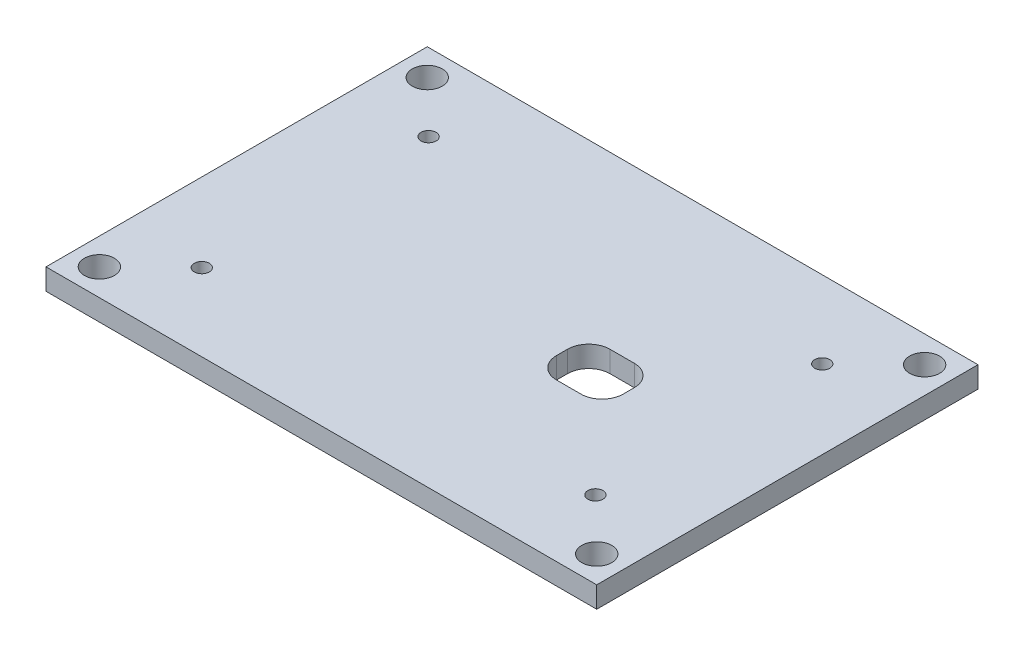
ISO-10303-21;
HEADER;
FILE_DESCRIPTION(('STEP AP214'),'2;1');
FILE_NAME('part.step','',(''),(''),'','','');
FILE_SCHEMA(('AUTOMOTIVE_DESIGN { 1 0 10303 214 1 1 1 1 }'));
ENDSEC;
DATA;
#1=APPLICATION_CONTEXT('core data for automotive mechanical design processes');
#2=APPLICATION_PROTOCOL_DEFINITION('international standard','automotive_design',2000,#1);
#3=PRODUCT_CONTEXT('',#1,'mechanical');
#4=PRODUCT('Part','Part','',(#3));
#5=PRODUCT_RELATED_PRODUCT_CATEGORY('part','',(#4));
#6=PRODUCT_DEFINITION_FORMATION('','',#4);
#7=PRODUCT_DEFINITION_CONTEXT('part definition',#1,'design');
#8=PRODUCT_DEFINITION('design','',#6,#7);
#9=PRODUCT_DEFINITION_SHAPE('','',#8);
#10=(LENGTH_UNIT() NAMED_UNIT(*) SI_UNIT(.MILLI.,.METRE.));
#11=(NAMED_UNIT(*) PLANE_ANGLE_UNIT() SI_UNIT($,.RADIAN.));
#12=(NAMED_UNIT(*) SI_UNIT($,.STERADIAN.) SOLID_ANGLE_UNIT());
#13=UNCERTAINTY_MEASURE_WITH_UNIT(LENGTH_MEASURE(1.E-05),#10,'distance_accuracy_value','');
#14=(GEOMETRIC_REPRESENTATION_CONTEXT(3) GLOBAL_UNCERTAINTY_ASSIGNED_CONTEXT((#13)) GLOBAL_UNIT_ASSIGNED_CONTEXT((#10,
#11,#12)) REPRESENTATION_CONTEXT('',''));
#15=CARTESIAN_POINT('',(0.,0.,0.));
#16=DIRECTION('',(0.,0.,1.));
#17=DIRECTION('',(1.,0.,0.));
#18=AXIS2_PLACEMENT_3D('',#15,#16,#17);
#19=CARTESIAN_POINT('',(-41.275,3.175,28.575));
#20=DIRECTION('',(1.,0.,0.));
#21=DIRECTION('',(0.,0.,-1.));
#22=AXIS2_PLACEMENT_3D('',#19,#20,#21);
#23=PLANE('',#22);
#24=DIRECTION('',(0.,0.,1.));
#25=VECTOR('',#24,1.);
#26=CARTESIAN_POINT('',(-41.275,0.,28.575));
#27=LINE('',#26,#25);
#28=CARTESIAN_POINT('',(-41.275,0.,-28.575));
#29=VERTEX_POINT('',#28);
#30=CARTESIAN_POINT('',(-41.275,0.,28.575));
#31=VERTEX_POINT('',#30);
#32=EDGE_CURVE('E190',#29,#31,#27,.T.);
#33=ORIENTED_EDGE('',*,*,#32,.T.);
#34=DIRECTION('',(0.,-1.,0.));
#35=VECTOR('',#34,1.);
#36=CARTESIAN_POINT('',(-41.275,3.175,28.575));
#37=LINE('',#36,#35);
#38=CARTESIAN_POINT('',(-41.275,3.175,28.575));
#39=VERTEX_POINT('',#38);
#40=EDGE_CURVE('E11',#39,#31,#37,.T.);
#41=ORIENTED_EDGE('',*,*,#40,.F.);
#42=DIRECTION('',(0.,0.,1.));
#43=VECTOR('',#42,1.);
#44=CARTESIAN_POINT('',(-41.275,3.175,28.575));
#45=LINE('',#44,#43);
#46=CARTESIAN_POINT('',(-41.275,3.175,-28.575));
#47=VERTEX_POINT('',#46);
#48=EDGE_CURVE('E191',#47,#39,#45,.T.);
#49=ORIENTED_EDGE('',*,*,#48,.F.);
#50=DIRECTION('',(0.,-1.,0.));
#51=VECTOR('',#50,1.);
#52=CARTESIAN_POINT('',(-41.275,3.175,-28.575));
#53=LINE('',#52,#51);
#54=EDGE_CURVE('E201',#47,#29,#53,.T.);
#55=ORIENTED_EDGE('',*,*,#54,.T.);
#56=EDGE_LOOP('',(#33,#41,#49,#55));
#57=FACE_BOUND('',#56,.T.);
#58=ADVANCED_FACE('F38',(#57),#23,.F.);
#59=CARTESIAN_POINT('',(41.275,3.175,28.575));
#60=DIRECTION('',(0.,0.,-1.));
#61=DIRECTION('',(-1.,0.,0.));
#62=AXIS2_PLACEMENT_3D('',#59,#60,#61);
#63=PLANE('',#62);
#64=DIRECTION('',(1.,0.,0.));
#65=VECTOR('',#64,1.);
#66=CARTESIAN_POINT('',(41.275,0.,28.575));
#67=LINE('',#66,#65);
#68=CARTESIAN_POINT('',(41.275,0.,28.575));
#69=VERTEX_POINT('',#68);
#70=EDGE_CURVE('E204',#31,#69,#67,.T.);
#71=ORIENTED_EDGE('',*,*,#70,.T.);
#72=DIRECTION('',(0.,-1.,0.));
#73=VECTOR('',#72,1.);
#74=CARTESIAN_POINT('',(41.275,3.175,28.575));
#75=LINE('',#74,#73);
#76=CARTESIAN_POINT('',(41.275,3.175,28.575));
#77=VERTEX_POINT('',#76);
#78=EDGE_CURVE('E45',#77,#69,#75,.T.);
#79=ORIENTED_EDGE('',*,*,#78,.F.);
#80=DIRECTION('',(1.,0.,0.));
#81=VECTOR('',#80,1.);
#82=CARTESIAN_POINT('',(41.275,3.175,28.575));
#83=LINE('',#82,#81);
#84=EDGE_CURVE('E194',#39,#77,#83,.T.);
#85=ORIENTED_EDGE('',*,*,#84,.F.);
#86=ORIENTED_EDGE('',*,*,#40,.T.);
#87=EDGE_LOOP('',(#71,#79,#85,#86));
#88=FACE_BOUND('',#87,.T.);
#89=ADVANCED_FACE('F232',(#88),#63,.F.);
#90=CARTESIAN_POINT('',(41.275,3.175,28.575));
#91=DIRECTION('',(-1.,0.,0.));
#92=DIRECTION('',(0.,0.,1.));
#93=AXIS2_PLACEMENT_3D('',#90,#91,#92);
#94=PLANE('',#93);
#95=DIRECTION('',(0.,0.,-1.));
#96=VECTOR('',#95,1.);
#97=CARTESIAN_POINT('',(41.275,0.,28.575));
#98=LINE('',#97,#96);
#99=CARTESIAN_POINT('',(41.275,0.,-28.575));
#100=VERTEX_POINT('',#99);
#101=EDGE_CURVE('E206',#69,#100,#98,.T.);
#102=ORIENTED_EDGE('',*,*,#101,.T.);
#103=DIRECTION('',(0.,-1.,0.));
#104=VECTOR('',#103,1.);
#105=CARTESIAN_POINT('',(41.275,3.175,-28.575));
#106=LINE('',#105,#104);
#107=CARTESIAN_POINT('',(41.275,3.175,-28.575));
#108=VERTEX_POINT('',#107);
#109=EDGE_CURVE('E211',#108,#100,#106,.T.);
#110=ORIENTED_EDGE('',*,*,#109,.F.);
#111=DIRECTION('',(0.,0.,-1.));
#112=VECTOR('',#111,1.);
#113=CARTESIAN_POINT('',(41.275,3.175,28.575));
#114=LINE('',#113,#112);
#115=EDGE_CURVE('E197',#77,#108,#114,.T.);
#116=ORIENTED_EDGE('',*,*,#115,.F.);
#117=ORIENTED_EDGE('',*,*,#78,.T.);
#118=EDGE_LOOP('',(#102,#110,#116,#117));
#119=FACE_BOUND('',#118,.T.);
#120=ADVANCED_FACE('F218',(#119),#94,.F.);
#121=CARTESIAN_POINT('',(41.275,3.175,-28.575));
#122=DIRECTION('',(0.,0.,1.));
#123=DIRECTION('',(1.,0.,0.));
#124=AXIS2_PLACEMENT_3D('',#121,#122,#123);
#125=PLANE('',#124);
#126=DIRECTION('',(-1.,0.,0.));
#127=VECTOR('',#126,1.);
#128=CARTESIAN_POINT('',(41.275,0.,-28.575));
#129=LINE('',#128,#127);
#130=EDGE_CURVE('E195',#100,#29,#129,.T.);
#131=ORIENTED_EDGE('',*,*,#130,.T.);
#132=ORIENTED_EDGE('',*,*,#54,.F.);
#133=DIRECTION('',(-1.,0.,0.));
#134=VECTOR('',#133,1.);
#135=CARTESIAN_POINT('',(41.275,3.175,-28.575));
#136=LINE('',#135,#134);
#137=EDGE_CURVE('E199',#108,#47,#136,.T.);
#138=ORIENTED_EDGE('',*,*,#137,.F.);
#139=ORIENTED_EDGE('',*,*,#109,.T.);
#140=EDGE_LOOP('',(#131,#132,#138,#139));
#141=FACE_BOUND('',#140,.T.);
#142=ADVANCED_FACE('F225',(#141),#125,.F.);
#143=CARTESIAN_POINT('',(0.,3.175,0.));
#144=DIRECTION('',(0.,1.,0.));
#145=DIRECTION('',(0.,0.,1.));
#146=AXIS2_PLACEMENT_3D('',#143,#144,#145);
#147=PLANE('',#146);
#148=CARTESIAN_POINT('',(-29.5,3.175,17.));
#149=DIRECTION('',(0.,1.,0.));
#150=DIRECTION('',(0.,0.,1.));
#151=AXIS2_PLACEMENT_3D('',#148,#149,#150);
#152=CIRCLE('',#151,1.1303);
#153=CARTESIAN_POINT('',(-29.5,3.175,18.1303));
#154=VERTEX_POINT('',#153);
#155=EDGE_CURVE('E314',#154,#154,#152,.T.);
#156=ORIENTED_EDGE('',*,*,#155,.F.);
#157=EDGE_LOOP('',(#156));
#158=FACE_BOUND('',#157,.T.);
#159=CARTESIAN_POINT('',(-29.5,3.175,-17.));
#160=DIRECTION('',(0.,1.,0.));
#161=DIRECTION('',(0.,0.,1.));
#162=AXIS2_PLACEMENT_3D('',#159,#160,#161);
#163=CIRCLE('',#162,1.1303);
#164=CARTESIAN_POINT('',(-29.5,3.175,-15.8697));
#165=VERTEX_POINT('',#164);
#166=EDGE_CURVE('E316',#165,#165,#163,.T.);
#167=ORIENTED_EDGE('',*,*,#166,.F.);
#168=EDGE_LOOP('',(#167));
#169=FACE_BOUND('',#168,.T.);
#170=CARTESIAN_POINT('',(29.5,3.175,-17.));
#171=DIRECTION('',(0.,1.,0.));
#172=DIRECTION('',(0.,0.,1.));
#173=AXIS2_PLACEMENT_3D('',#170,#171,#172);
#174=CIRCLE('',#173,1.1303);
#175=CARTESIAN_POINT('',(29.5,3.175,-15.8697));
#176=VERTEX_POINT('',#175);
#177=EDGE_CURVE('E324',#176,#176,#174,.T.);
#178=ORIENTED_EDGE('',*,*,#177,.F.);
#179=EDGE_LOOP('',(#178));
#180=FACE_BOUND('',#179,.T.);
#181=CARTESIAN_POINT('',(29.5,3.175,17.));
#182=DIRECTION('',(0.,1.,0.));
#183=DIRECTION('',(0.,0.,1.));
#184=AXIS2_PLACEMENT_3D('',#181,#182,#183);
#185=CIRCLE('',#184,1.1303);
#186=CARTESIAN_POINT('',(29.5,3.175,18.1303));
#187=VERTEX_POINT('',#186);
#188=EDGE_CURVE('E330',#187,#187,#185,.T.);
#189=ORIENTED_EDGE('',*,*,#188,.F.);
#190=EDGE_LOOP('',(#189));
#191=FACE_BOUND('',#190,.T.);
#192=CARTESIAN_POINT('',(37.275,3.175,-24.575));
#193=DIRECTION('',(0.,-1.,0.));
#194=DIRECTION('',(0.,0.,-1.));
#195=AXIS2_PLACEMENT_3D('',#192,#193,#194);
#196=CIRCLE('',#195,2.2479);
#197=CARTESIAN_POINT('',(37.275,3.175,-26.8229));
#198=VERTEX_POINT('',#197);
#199=EDGE_CURVE('E339',#198,#198,#196,.T.);
#200=ORIENTED_EDGE('',*,*,#199,.T.);
#201=EDGE_LOOP('',(#200));
#202=FACE_BOUND('',#201,.T.);
#203=CARTESIAN_POINT('',(-37.275,3.175,-24.575));
#204=DIRECTION('',(0.,-1.,0.));
#205=DIRECTION('',(0.,0.,-1.));
#206=AXIS2_PLACEMENT_3D('',#203,#204,#205);
#207=CIRCLE('',#206,2.2479);
#208=CARTESIAN_POINT('',(-37.275,3.175,-26.8229));
#209=VERTEX_POINT('',#208);
#210=EDGE_CURVE('E345',#209,#209,#207,.T.);
#211=ORIENTED_EDGE('',*,*,#210,.T.);
#212=EDGE_LOOP('',(#211));
#213=FACE_BOUND('',#212,.T.);
#214=CARTESIAN_POINT('',(-37.275,3.175,24.575));
#215=DIRECTION('',(0.,-1.,0.));
#216=DIRECTION('',(0.,0.,-1.));
#217=AXIS2_PLACEMENT_3D('',#214,#215,#216);
#218=CIRCLE('',#217,2.2479);
#219=CARTESIAN_POINT('',(-37.275,3.175,22.3271));
#220=VERTEX_POINT('',#219);
#221=EDGE_CURVE('E351',#220,#220,#218,.T.);
#222=ORIENTED_EDGE('',*,*,#221,.T.);
#223=EDGE_LOOP('',(#222));
#224=FACE_BOUND('',#223,.T.);
#225=CARTESIAN_POINT('',(37.275,3.175,24.575));
#226=DIRECTION('',(0.,-1.,0.));
#227=DIRECTION('',(0.,0.,-1.));
#228=AXIS2_PLACEMENT_3D('',#225,#226,#227);
#229=CIRCLE('',#228,2.2479);
#230=CARTESIAN_POINT('',(37.275,3.175,22.3271));
#231=VERTEX_POINT('',#230);
#232=EDGE_CURVE('E357',#231,#231,#229,.T.);
#233=ORIENTED_EDGE('',*,*,#232,.T.);
#234=EDGE_LOOP('',(#233));
#235=FACE_BOUND('',#234,.T.);
#236=CARTESIAN_POINT('',(11.675,3.175,1.82500000000001));
#237=DIRECTION('',(0.,1.,0.));
#238=DIRECTION('',(0.,0.,1.));
#239=AXIS2_PLACEMENT_3D('',#236,#237,#238);
#240=CIRCLE('',#239,3.175);
#241=CARTESIAN_POINT('',(8.49999999999999,3.175,1.82500000000001));
#242=VERTEX_POINT('',#241);
#243=CARTESIAN_POINT('',(11.675,3.175,5.00000000000001));
#244=VERTEX_POINT('',#243);
#245=EDGE_CURVE('E188',#242,#244,#240,.T.);
#246=ORIENTED_EDGE('',*,*,#245,.F.);
#247=DIRECTION('',(0.,0.,1.));
#248=VECTOR('',#247,1.);
#249=CARTESIAN_POINT('',(8.49999999999999,3.175,0.));
#250=LINE('',#249,#248);
#251=CARTESIAN_POINT('',(8.49999999999999,3.175,0.175000000000008));
#252=VERTEX_POINT('',#251);
#253=EDGE_CURVE('E165',#252,#242,#250,.T.);
#254=ORIENTED_EDGE('',*,*,#253,.F.);
#255=CARTESIAN_POINT('',(11.675,3.175,0.175000000000008));
#256=DIRECTION('',(0.,1.,0.));
#257=DIRECTION('',(0.,0.,1.));
#258=AXIS2_PLACEMENT_3D('',#255,#256,#257);
#259=CIRCLE('',#258,3.175);
#260=CARTESIAN_POINT('',(11.675,3.175,-2.99999999999999));
#261=VERTEX_POINT('',#260);
#262=EDGE_CURVE('E132',#261,#252,#259,.T.);
#263=ORIENTED_EDGE('',*,*,#262,.F.);
#264=DIRECTION('',(-1.,0.,0.));
#265=VECTOR('',#264,1.);
#266=CARTESIAN_POINT('',(0.,3.175,-3.));
#267=LINE('',#266,#265);
#268=CARTESIAN_POINT('',(15.325,3.175,-2.99999999999999));
#269=VERTEX_POINT('',#268);
#270=EDGE_CURVE('E178',#269,#261,#267,.T.);
#271=ORIENTED_EDGE('',*,*,#270,.F.);
#272=CARTESIAN_POINT('',(15.325,3.175,0.175000000000008));
#273=DIRECTION('',(0.,1.,0.));
#274=DIRECTION('',(0.,0.,1.));
#275=AXIS2_PLACEMENT_3D('',#272,#273,#274);
#276=CIRCLE('',#275,3.175);
#277=CARTESIAN_POINT('',(18.5,3.175,0.175000000000008));
#278=VERTEX_POINT('',#277);
#279=EDGE_CURVE('E180',#278,#269,#276,.T.);
#280=ORIENTED_EDGE('',*,*,#279,.F.);
#281=DIRECTION('',(0.,0.,-1.));
#282=VECTOR('',#281,1.);
#283=CARTESIAN_POINT('',(18.5,3.175,0.));
#284=LINE('',#283,#282);
#285=CARTESIAN_POINT('',(18.5,3.175,1.82500000000001));
#286=VERTEX_POINT('',#285);
#287=EDGE_CURVE('E182',#286,#278,#284,.T.);
#288=ORIENTED_EDGE('',*,*,#287,.F.);
#289=CARTESIAN_POINT('',(15.325,3.175,1.82500000000001));
#290=DIRECTION('',(0.,1.,0.));
#291=DIRECTION('',(0.,0.,1.));
#292=AXIS2_PLACEMENT_3D('',#289,#290,#291);
#293=CIRCLE('',#292,3.175);
#294=CARTESIAN_POINT('',(15.325,3.175,5.00000000000001));
#295=VERTEX_POINT('',#294);
#296=EDGE_CURVE('E184',#295,#286,#293,.T.);
#297=ORIENTED_EDGE('',*,*,#296,.F.);
#298=DIRECTION('',(1.,0.,0.));
#299=VECTOR('',#298,1.);
#300=CARTESIAN_POINT('',(0.,3.175,5.00000000000001));
#301=LINE('',#300,#299);
#302=EDGE_CURVE('E186',#244,#295,#301,.T.);
#303=ORIENTED_EDGE('',*,*,#302,.F.);
#304=EDGE_LOOP('',(#246,#254,#263,#271,#280,#288,#297,#303));
#305=FACE_BOUND('',#304,.T.);
#306=ORIENTED_EDGE('',*,*,#48,.T.);
#307=ORIENTED_EDGE('',*,*,#84,.T.);
#308=ORIENTED_EDGE('',*,*,#115,.T.);
#309=ORIENTED_EDGE('',*,*,#137,.T.);
#310=EDGE_LOOP('',(#306,#307,#308,#309));
#311=FACE_BOUND('',#310,.T.);
#312=ADVANCED_FACE('F231',(#158,#169,#180,#191,#202,#213,#224,#235,#305,#311),#147,.T.);
#313=CARTESIAN_POINT('',(0.,0.,0.));
#314=DIRECTION('',(0.,1.,0.));
#315=DIRECTION('',(0.,0.,1.));
#316=AXIS2_PLACEMENT_3D('',#313,#314,#315);
#317=PLANE('',#316);
#318=CARTESIAN_POINT('',(-29.5,0.,17.));
#319=DIRECTION('',(0.,1.,0.));
#320=DIRECTION('',(0.,0.,1.));
#321=AXIS2_PLACEMENT_3D('',#318,#319,#320);
#322=CIRCLE('',#321,1.1303);
#323=CARTESIAN_POINT('',(-29.5,0.,18.1303));
#324=VERTEX_POINT('',#323);
#325=EDGE_CURVE('E311',#324,#324,#322,.T.);
#326=ORIENTED_EDGE('',*,*,#325,.T.);
#327=EDGE_LOOP('',(#326));
#328=FACE_BOUND('',#327,.T.);
#329=CARTESIAN_POINT('',(-29.5,0.,-17.));
#330=DIRECTION('',(0.,1.,0.));
#331=DIRECTION('',(0.,0.,1.));
#332=AXIS2_PLACEMENT_3D('',#329,#330,#331);
#333=CIRCLE('',#332,1.1303);
#334=CARTESIAN_POINT('',(-29.5,0.,-15.8697));
#335=VERTEX_POINT('',#334);
#336=EDGE_CURVE('E321',#335,#335,#333,.T.);
#337=ORIENTED_EDGE('',*,*,#336,.T.);
#338=EDGE_LOOP('',(#337));
#339=FACE_BOUND('',#338,.T.);
#340=CARTESIAN_POINT('',(29.5,0.,-17.));
#341=DIRECTION('',(0.,1.,0.));
#342=DIRECTION('',(0.,0.,1.));
#343=AXIS2_PLACEMENT_3D('',#340,#341,#342);
#344=CIRCLE('',#343,1.1303);
#345=CARTESIAN_POINT('',(29.5,0.,-15.8697));
#346=VERTEX_POINT('',#345);
#347=EDGE_CURVE('E327',#346,#346,#344,.T.);
#348=ORIENTED_EDGE('',*,*,#347,.T.);
#349=EDGE_LOOP('',(#348));
#350=FACE_BOUND('',#349,.T.);
#351=CARTESIAN_POINT('',(29.5,0.,17.));
#352=DIRECTION('',(0.,1.,0.));
#353=DIRECTION('',(0.,0.,1.));
#354=AXIS2_PLACEMENT_3D('',#351,#352,#353);
#355=CIRCLE('',#354,1.1303);
#356=CARTESIAN_POINT('',(29.5,0.,18.1303));
#357=VERTEX_POINT('',#356);
#358=EDGE_CURVE('E333',#357,#357,#355,.T.);
#359=ORIENTED_EDGE('',*,*,#358,.T.);
#360=EDGE_LOOP('',(#359));
#361=FACE_BOUND('',#360,.T.);
#362=CARTESIAN_POINT('',(37.275,0.,-24.575));
#363=DIRECTION('',(0.,-1.,0.));
#364=DIRECTION('',(0.,0.,-1.));
#365=AXIS2_PLACEMENT_3D('',#362,#363,#364);
#366=CIRCLE('',#365,2.2479);
#367=CARTESIAN_POINT('',(37.275,0.,-26.8229));
#368=VERTEX_POINT('',#367);
#369=EDGE_CURVE('E336',#368,#368,#366,.T.);
#370=ORIENTED_EDGE('',*,*,#369,.F.);
#371=EDGE_LOOP('',(#370));
#372=FACE_BOUND('',#371,.T.);
#373=CARTESIAN_POINT('',(-37.275,0.,-24.575));
#374=DIRECTION('',(0.,-1.,0.));
#375=DIRECTION('',(0.,0.,-1.));
#376=AXIS2_PLACEMENT_3D('',#373,#374,#375);
#377=CIRCLE('',#376,2.2479);
#378=CARTESIAN_POINT('',(-37.275,0.,-26.8229));
#379=VERTEX_POINT('',#378);
#380=EDGE_CURVE('E342',#379,#379,#377,.T.);
#381=ORIENTED_EDGE('',*,*,#380,.F.);
#382=EDGE_LOOP('',(#381));
#383=FACE_BOUND('',#382,.T.);
#384=CARTESIAN_POINT('',(-37.275,0.,24.575));
#385=DIRECTION('',(0.,-1.,0.));
#386=DIRECTION('',(0.,0.,-1.));
#387=AXIS2_PLACEMENT_3D('',#384,#385,#386);
#388=CIRCLE('',#387,2.2479);
#389=CARTESIAN_POINT('',(-37.275,0.,22.3271));
#390=VERTEX_POINT('',#389);
#391=EDGE_CURVE('E348',#390,#390,#388,.T.);
#392=ORIENTED_EDGE('',*,*,#391,.F.);
#393=EDGE_LOOP('',(#392));
#394=FACE_BOUND('',#393,.T.);
#395=CARTESIAN_POINT('',(37.275,0.,24.575));
#396=DIRECTION('',(0.,-1.,0.));
#397=DIRECTION('',(0.,0.,-1.));
#398=AXIS2_PLACEMENT_3D('',#395,#396,#397);
#399=CIRCLE('',#398,2.2479);
#400=CARTESIAN_POINT('',(37.275,0.,22.3271));
#401=VERTEX_POINT('',#400);
#402=EDGE_CURVE('E354',#401,#401,#399,.T.);
#403=ORIENTED_EDGE('',*,*,#402,.F.);
#404=EDGE_LOOP('',(#403));
#405=FACE_BOUND('',#404,.T.);
#406=DIRECTION('',(0.,0.,-1.));
#407=VECTOR('',#406,1.);
#408=CARTESIAN_POINT('',(8.49999999999999,0.,1.82500000000001));
#409=LINE('',#408,#407);
#410=CARTESIAN_POINT('',(8.49999999999999,0.,1.82500000000001));
#411=VERTEX_POINT('',#410);
#412=CARTESIAN_POINT('',(8.49999999999999,0.,0.175000000000008));
#413=VERTEX_POINT('',#412);
#414=EDGE_CURVE('E138',#411,#413,#409,.T.);
#415=ORIENTED_EDGE('',*,*,#414,.F.);
#416=CARTESIAN_POINT('',(11.675,0.,1.82500000000001));
#417=DIRECTION('',(0.,-1.,0.));
#418=DIRECTION('',(0.,0.,1.));
#419=AXIS2_PLACEMENT_3D('',#416,#417,#418);
#420=CIRCLE('',#419,3.175);
#421=CARTESIAN_POINT('',(11.675,0.,5.00000000000001));
#422=VERTEX_POINT('',#421);
#423=EDGE_CURVE('E60',#422,#411,#420,.T.);
#424=ORIENTED_EDGE('',*,*,#423,.F.);
#425=DIRECTION('',(-1.,0.,0.));
#426=VECTOR('',#425,1.);
#427=CARTESIAN_POINT('',(15.325,0.,5.00000000000001));
#428=LINE('',#427,#426);
#429=CARTESIAN_POINT('',(15.325,0.,5.00000000000001));
#430=VERTEX_POINT('',#429);
#431=EDGE_CURVE('E160',#430,#422,#428,.T.);
#432=ORIENTED_EDGE('',*,*,#431,.F.);
#433=CARTESIAN_POINT('',(15.325,0.,1.82500000000001));
#434=DIRECTION('',(0.,-1.,0.));
#435=DIRECTION('',(0.,0.,-1.));
#436=AXIS2_PLACEMENT_3D('',#433,#434,#435);
#437=CIRCLE('',#436,3.175);
#438=CARTESIAN_POINT('',(18.5,0.,1.82500000000001));
#439=VERTEX_POINT('',#438);
#440=EDGE_CURVE('E157',#439,#430,#437,.T.);
#441=ORIENTED_EDGE('',*,*,#440,.F.);
#442=DIRECTION('',(0.,0.,1.));
#443=VECTOR('',#442,1.);
#444=CARTESIAN_POINT('',(18.5,0.,0.175000000000008));
#445=LINE('',#444,#443);
#446=CARTESIAN_POINT('',(18.5,0.,0.175000000000008));
#447=VERTEX_POINT('',#446);
#448=EDGE_CURVE('E154',#447,#439,#445,.T.);
#449=ORIENTED_EDGE('',*,*,#448,.F.);
#450=CARTESIAN_POINT('',(15.325,0.,0.175000000000008));
#451=DIRECTION('',(0.,-1.,0.));
#452=DIRECTION('',(0.,0.,-1.));
#453=AXIS2_PLACEMENT_3D('',#450,#451,#452);
#454=CIRCLE('',#453,3.175);
#455=CARTESIAN_POINT('',(15.325,0.,-2.99999999999999));
#456=VERTEX_POINT('',#455);
#457=EDGE_CURVE('E148',#456,#447,#454,.T.);
#458=ORIENTED_EDGE('',*,*,#457,.F.);
#459=DIRECTION('',(1.,0.,0.));
#460=VECTOR('',#459,1.);
#461=CARTESIAN_POINT('',(11.675,0.,-2.99999999999999));
#462=LINE('',#461,#460);
#463=CARTESIAN_POINT('',(11.675,0.,-2.99999999999999));
#464=VERTEX_POINT('',#463);
#465=EDGE_CURVE('E146',#464,#456,#462,.T.);
#466=ORIENTED_EDGE('',*,*,#465,.F.);
#467=CARTESIAN_POINT('',(11.675,0.,0.175000000000008));
#468=DIRECTION('',(0.,-1.,0.));
#469=DIRECTION('',(0.,0.,-1.));
#470=AXIS2_PLACEMENT_3D('',#467,#468,#469);
#471=CIRCLE('',#470,3.175);
#472=EDGE_CURVE('E129',#413,#464,#471,.T.);
#473=ORIENTED_EDGE('',*,*,#472,.F.);
#474=EDGE_LOOP('',(#415,#424,#432,#441,#449,#458,#466,#473));
#475=FACE_BOUND('',#474,.T.);
#476=ORIENTED_EDGE('',*,*,#32,.F.);
#477=ORIENTED_EDGE('',*,*,#130,.F.);
#478=ORIENTED_EDGE('',*,*,#101,.F.);
#479=ORIENTED_EDGE('',*,*,#70,.F.);
#480=EDGE_LOOP('',(#476,#477,#478,#479));
#481=FACE_BOUND('',#480,.T.);
#482=ADVANCED_FACE('F142',(#328,#339,#350,#361,#372,#383,#394,#405,#475,#481),#317,.F.);
#483=CARTESIAN_POINT('',(11.675,10.,1.82500000000001));
#484=DIRECTION('',(0.,-1.,0.));
#485=DIRECTION('',(0.,0.,-1.));
#486=AXIS2_PLACEMENT_3D('',#483,#484,#485);
#487=CYLINDRICAL_SURFACE('',#486,3.175);
#488=ORIENTED_EDGE('',*,*,#245,.T.);
#489=DIRECTION('',(0.,-1.,0.));
#490=VECTOR('',#489,1.);
#491=CARTESIAN_POINT('',(11.675,10.,5.00000000000001));
#492=LINE('',#491,#490);
#493=EDGE_CURVE('E163',#244,#422,#492,.T.);
#494=ORIENTED_EDGE('',*,*,#493,.T.);
#495=ORIENTED_EDGE('',*,*,#423,.T.);
#496=DIRECTION('',(0.,-1.,0.));
#497=VECTOR('',#496,1.);
#498=CARTESIAN_POINT('',(8.49999999999999,10.,1.82500000000001));
#499=LINE('',#498,#497);
#500=EDGE_CURVE('E135',#242,#411,#499,.T.);
#501=ORIENTED_EDGE('',*,*,#500,.F.);
#502=EDGE_LOOP('',(#488,#494,#495,#501));
#503=FACE_BOUND('',#502,.T.);
#504=ADVANCED_FACE('F244',(#503),#487,.F.);
#505=CARTESIAN_POINT('',(15.325,10.,5.00000000000001));
#506=DIRECTION('',(0.,0.,1.));
#507=DIRECTION('',(1.,0.,0.));
#508=AXIS2_PLACEMENT_3D('',#505,#506,#507);
#509=PLANE('',#508);
#510=ORIENTED_EDGE('',*,*,#302,.T.);
#511=DIRECTION('',(0.,-1.,0.));
#512=VECTOR('',#511,1.);
#513=CARTESIAN_POINT('',(15.325,10.,5.00000000000001));
#514=LINE('',#513,#512);
#515=EDGE_CURVE('E166',#295,#430,#514,.T.);
#516=ORIENTED_EDGE('',*,*,#515,.T.);
#517=ORIENTED_EDGE('',*,*,#431,.T.);
#518=ORIENTED_EDGE('',*,*,#493,.F.);
#519=EDGE_LOOP('',(#510,#516,#517,#518));
#520=FACE_BOUND('',#519,.T.);
#521=ADVANCED_FACE('F251',(#520),#509,.F.);
#522=CARTESIAN_POINT('',(15.325,10.,1.82500000000001));
#523=DIRECTION('',(0.,-1.,0.));
#524=DIRECTION('',(0.,0.,-1.));
#525=AXIS2_PLACEMENT_3D('',#522,#523,#524);
#526=CYLINDRICAL_SURFACE('',#525,3.175);
#527=ORIENTED_EDGE('',*,*,#296,.T.);
#528=DIRECTION('',(0.,-1.,0.));
#529=VECTOR('',#528,1.);
#530=CARTESIAN_POINT('',(18.5,10.,1.82500000000001));
#531=LINE('',#530,#529);
#532=EDGE_CURVE('E168',#286,#439,#531,.T.);
#533=ORIENTED_EDGE('',*,*,#532,.T.);
#534=ORIENTED_EDGE('',*,*,#440,.T.);
#535=ORIENTED_EDGE('',*,*,#515,.F.);
#536=EDGE_LOOP('',(#527,#533,#534,#535));
#537=FACE_BOUND('',#536,.T.);
#538=ADVANCED_FACE('F268',(#537),#526,.F.);
#539=CARTESIAN_POINT('',(18.5,10.,0.175000000000008));
#540=DIRECTION('',(1.,0.,0.));
#541=DIRECTION('',(0.,0.,-1.));
#542=AXIS2_PLACEMENT_3D('',#539,#540,#541);
#543=PLANE('',#542);
#544=ORIENTED_EDGE('',*,*,#287,.T.);
#545=DIRECTION('',(0.,-1.,0.));
#546=VECTOR('',#545,1.);
#547=CARTESIAN_POINT('',(18.5,10.,0.175000000000008));
#548=LINE('',#547,#546);
#549=EDGE_CURVE('E170',#278,#447,#548,.T.);
#550=ORIENTED_EDGE('',*,*,#549,.T.);
#551=ORIENTED_EDGE('',*,*,#448,.T.);
#552=ORIENTED_EDGE('',*,*,#532,.F.);
#553=EDGE_LOOP('',(#544,#550,#551,#552));
#554=FACE_BOUND('',#553,.T.);
#555=ADVANCED_FACE('F264',(#554),#543,.F.);
#556=CARTESIAN_POINT('',(15.325,10.,0.175000000000008));
#557=DIRECTION('',(0.,-1.,0.));
#558=DIRECTION('',(0.,0.,-1.));
#559=AXIS2_PLACEMENT_3D('',#556,#557,#558);
#560=CYLINDRICAL_SURFACE('',#559,3.175);
#561=ORIENTED_EDGE('',*,*,#279,.T.);
#562=DIRECTION('',(0.,-1.,0.));
#563=VECTOR('',#562,1.);
#564=CARTESIAN_POINT('',(15.325,10.,-2.99999999999999));
#565=LINE('',#564,#563);
#566=EDGE_CURVE('E172',#269,#456,#565,.T.);
#567=ORIENTED_EDGE('',*,*,#566,.T.);
#568=ORIENTED_EDGE('',*,*,#457,.T.);
#569=ORIENTED_EDGE('',*,*,#549,.F.);
#570=EDGE_LOOP('',(#561,#567,#568,#569));
#571=FACE_BOUND('',#570,.T.);
#572=ADVANCED_FACE('F260',(#571),#560,.F.);
#573=CARTESIAN_POINT('',(11.675,10.,-2.99999999999999));
#574=DIRECTION('',(0.,0.,-1.));
#575=DIRECTION('',(-1.,0.,0.));
#576=AXIS2_PLACEMENT_3D('',#573,#574,#575);
#577=PLANE('',#576);
#578=ORIENTED_EDGE('',*,*,#270,.T.);
#579=DIRECTION('',(0.,-1.,0.));
#580=VECTOR('',#579,1.);
#581=CARTESIAN_POINT('',(11.675,10.,-2.99999999999999));
#582=LINE('',#581,#580);
#583=EDGE_CURVE('E134',#261,#464,#582,.T.);
#584=ORIENTED_EDGE('',*,*,#583,.T.);
#585=ORIENTED_EDGE('',*,*,#465,.T.);
#586=ORIENTED_EDGE('',*,*,#566,.F.);
#587=EDGE_LOOP('',(#578,#584,#585,#586));
#588=FACE_BOUND('',#587,.T.);
#589=ADVANCED_FACE('F257',(#588),#577,.F.);
#590=CARTESIAN_POINT('',(11.675,10.,0.175000000000008));
#591=DIRECTION('',(0.,-1.,0.));
#592=DIRECTION('',(0.,0.,-1.));
#593=AXIS2_PLACEMENT_3D('',#590,#591,#592);
#594=CYLINDRICAL_SURFACE('',#593,3.175);
#595=ORIENTED_EDGE('',*,*,#262,.T.);
#596=DIRECTION('',(0.,-1.,0.));
#597=VECTOR('',#596,1.);
#598=CARTESIAN_POINT('',(8.49999999999999,10.,0.175000000000008));
#599=LINE('',#598,#597);
#600=EDGE_CURVE('E52',#252,#413,#599,.T.);
#601=ORIENTED_EDGE('',*,*,#600,.T.);
#602=ORIENTED_EDGE('',*,*,#472,.T.);
#603=ORIENTED_EDGE('',*,*,#583,.F.);
#604=EDGE_LOOP('',(#595,#601,#602,#603));
#605=FACE_BOUND('',#604,.T.);
#606=ADVANCED_FACE('F126',(#605),#594,.F.);
#607=CARTESIAN_POINT('',(8.49999999999999,10.,1.82500000000001));
#608=DIRECTION('',(-1.,0.,0.));
#609=DIRECTION('',(0.,0.,1.));
#610=AXIS2_PLACEMENT_3D('',#607,#608,#609);
#611=PLANE('',#610);
#612=ORIENTED_EDGE('',*,*,#253,.T.);
#613=ORIENTED_EDGE('',*,*,#500,.T.);
#614=ORIENTED_EDGE('',*,*,#414,.T.);
#615=ORIENTED_EDGE('',*,*,#600,.F.);
#616=EDGE_LOOP('',(#612,#613,#614,#615));
#617=FACE_BOUND('',#616,.T.);
#618=ADVANCED_FACE('F139',(#617),#611,.F.);
#619=CARTESIAN_POINT('',(37.275,0.,24.575));
#620=DIRECTION('',(0.,-1.,0.));
#621=DIRECTION('',(0.,0.,-1.));
#622=AXIS2_PLACEMENT_3D('',#619,#620,#621);
#623=CYLINDRICAL_SURFACE('',#622,2.2479);
#624=ORIENTED_EDGE('',*,*,#232,.F.);
#625=EDGE_LOOP('',(#624));
#626=FACE_BOUND('',#625,.T.);
#627=ORIENTED_EDGE('',*,*,#402,.T.);
#628=EDGE_LOOP('',(#627));
#629=FACE_BOUND('',#628,.T.);
#630=ADVANCED_FACE('F254',(#626,#629),#623,.F.);
#631=CARTESIAN_POINT('',(-37.275,0.,24.575));
#632=DIRECTION('',(0.,-1.,0.));
#633=DIRECTION('',(0.,0.,-1.));
#634=AXIS2_PLACEMENT_3D('',#631,#632,#633);
#635=CYLINDRICAL_SURFACE('',#634,2.2479);
#636=ORIENTED_EDGE('',*,*,#221,.F.);
#637=EDGE_LOOP('',(#636));
#638=FACE_BOUND('',#637,.T.);
#639=ORIENTED_EDGE('',*,*,#391,.T.);
#640=EDGE_LOOP('',(#639));
#641=FACE_BOUND('',#640,.T.);
#642=ADVANCED_FACE('F278',(#638,#641),#635,.F.);
#643=CARTESIAN_POINT('',(-37.275,0.,-24.575));
#644=DIRECTION('',(0.,-1.,0.));
#645=DIRECTION('',(0.,0.,-1.));
#646=AXIS2_PLACEMENT_3D('',#643,#644,#645);
#647=CYLINDRICAL_SURFACE('',#646,2.2479);
#648=ORIENTED_EDGE('',*,*,#210,.F.);
#649=EDGE_LOOP('',(#648));
#650=FACE_BOUND('',#649,.T.);
#651=ORIENTED_EDGE('',*,*,#380,.T.);
#652=EDGE_LOOP('',(#651));
#653=FACE_BOUND('',#652,.T.);
#654=ADVANCED_FACE('F282',(#650,#653),#647,.F.);
#655=CARTESIAN_POINT('',(37.275,0.,-24.575));
#656=DIRECTION('',(0.,-1.,0.));
#657=DIRECTION('',(0.,0.,-1.));
#658=AXIS2_PLACEMENT_3D('',#655,#656,#657);
#659=CYLINDRICAL_SURFACE('',#658,2.2479);
#660=ORIENTED_EDGE('',*,*,#199,.F.);
#661=EDGE_LOOP('',(#660));
#662=FACE_BOUND('',#661,.T.);
#663=ORIENTED_EDGE('',*,*,#369,.T.);
#664=EDGE_LOOP('',(#663));
#665=FACE_BOUND('',#664,.T.);
#666=ADVANCED_FACE('F286',(#662,#665),#659,.F.);
#667=CARTESIAN_POINT('',(29.5,3.175,17.));
#668=DIRECTION('',(0.,1.,0.));
#669=DIRECTION('',(0.,0.,1.));
#670=AXIS2_PLACEMENT_3D('',#667,#668,#669);
#671=CYLINDRICAL_SURFACE('',#670,1.1303);
#672=ORIENTED_EDGE('',*,*,#358,.F.);
#673=EDGE_LOOP('',(#672));
#674=FACE_BOUND('',#673,.T.);
#675=ORIENTED_EDGE('',*,*,#188,.T.);
#676=EDGE_LOOP('',(#675));
#677=FACE_BOUND('',#676,.T.);
#678=ADVANCED_FACE('F290',(#674,#677),#671,.F.);
#679=CARTESIAN_POINT('',(29.5,3.175,-17.));
#680=DIRECTION('',(0.,1.,0.));
#681=DIRECTION('',(0.,0.,1.));
#682=AXIS2_PLACEMENT_3D('',#679,#680,#681);
#683=CYLINDRICAL_SURFACE('',#682,1.1303);
#684=ORIENTED_EDGE('',*,*,#347,.F.);
#685=EDGE_LOOP('',(#684));
#686=FACE_BOUND('',#685,.T.);
#687=ORIENTED_EDGE('',*,*,#177,.T.);
#688=EDGE_LOOP('',(#687));
#689=FACE_BOUND('',#688,.T.);
#690=ADVANCED_FACE('F294',(#686,#689),#683,.F.);
#691=CARTESIAN_POINT('',(-29.5,3.175,-17.));
#692=DIRECTION('',(0.,1.,0.));
#693=DIRECTION('',(0.,0.,1.));
#694=AXIS2_PLACEMENT_3D('',#691,#692,#693);
#695=CYLINDRICAL_SURFACE('',#694,1.1303);
#696=ORIENTED_EDGE('',*,*,#336,.F.);
#697=EDGE_LOOP('',(#696));
#698=FACE_BOUND('',#697,.T.);
#699=ORIENTED_EDGE('',*,*,#166,.T.);
#700=EDGE_LOOP('',(#699));
#701=FACE_BOUND('',#700,.T.);
#702=ADVANCED_FACE('F298',(#698,#701),#695,.F.);
#703=CARTESIAN_POINT('',(-29.5,3.175,17.));
#704=DIRECTION('',(0.,1.,0.));
#705=DIRECTION('',(0.,0.,1.));
#706=AXIS2_PLACEMENT_3D('',#703,#704,#705);
#707=CYLINDRICAL_SURFACE('',#706,1.1303);
#708=ORIENTED_EDGE('',*,*,#325,.F.);
#709=EDGE_LOOP('',(#708));
#710=FACE_BOUND('',#709,.T.);
#711=ORIENTED_EDGE('',*,*,#155,.T.);
#712=EDGE_LOOP('',(#711));
#713=FACE_BOUND('',#712,.T.);
#714=ADVANCED_FACE('F302',(#710,#713),#707,.F.);
#715=CLOSED_SHELL('',(#58,#89,#120,#142,#312,#482,#504,#521,#538,#555,#572,#589,#606,#618,#630,
#642,#654,#666,#678,#690,#702,#714));
#716=MANIFOLD_SOLID_BREP('B2',#715);
#717=ADVANCED_BREP_SHAPE_REPRESENTATION('',(#18,#716),#14);
#718=SHAPE_DEFINITION_REPRESENTATION(#9,#717);
ENDSEC;
END-ISO-10303-21;
